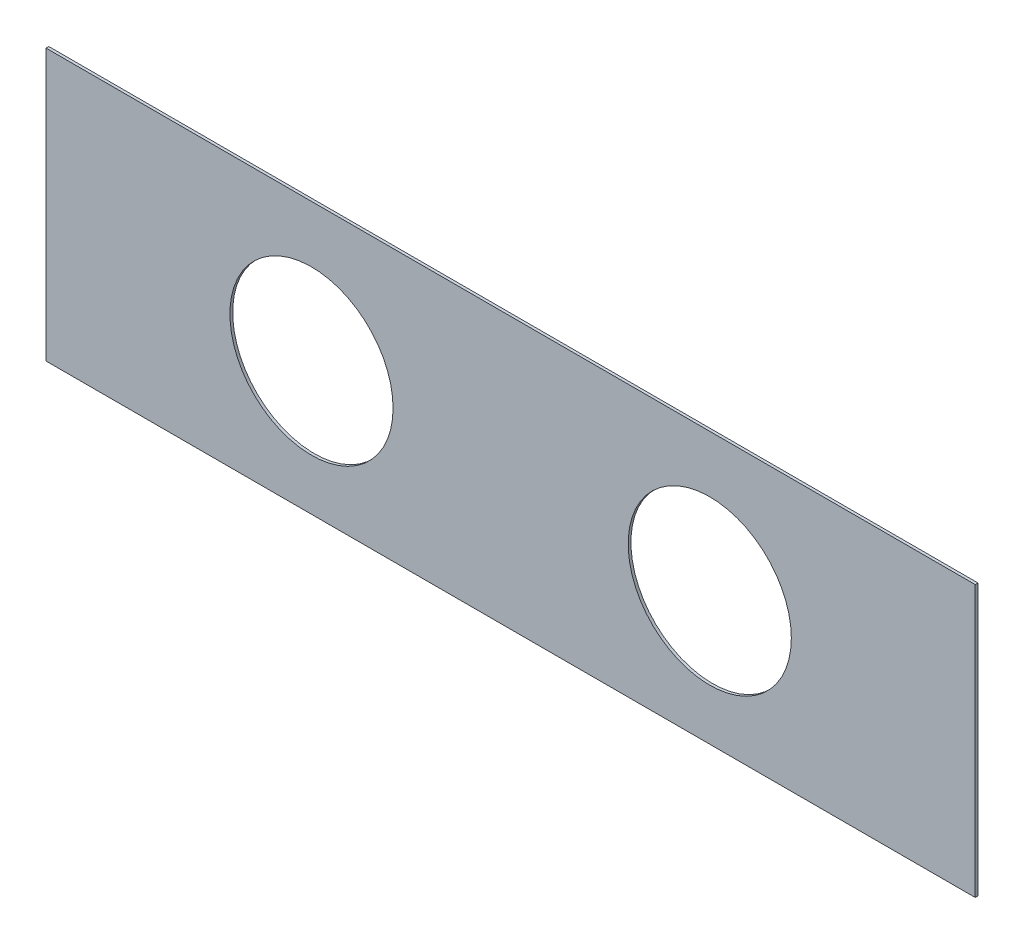
ISO-10303-21;
HEADER;
FILE_DESCRIPTION(('STEP AP214'),'2;1');
FILE_NAME('part.step','',(''),(''),'','','');
FILE_SCHEMA(('AUTOMOTIVE_DESIGN { 1 0 10303 214 1 1 1 1 }'));
ENDSEC;
DATA;
#1=APPLICATION_CONTEXT('core data for automotive mechanical design processes');
#2=APPLICATION_PROTOCOL_DEFINITION('international standard','automotive_design',2000,#1);
#3=PRODUCT_CONTEXT('',#1,'mechanical');
#4=PRODUCT('Part','Part','',(#3));
#5=PRODUCT_RELATED_PRODUCT_CATEGORY('part','',(#4));
#6=PRODUCT_DEFINITION_FORMATION('','',#4);
#7=PRODUCT_DEFINITION_CONTEXT('part definition',#1,'design');
#8=PRODUCT_DEFINITION('design','',#6,#7);
#9=PRODUCT_DEFINITION_SHAPE('','',#8);
#10=(LENGTH_UNIT() NAMED_UNIT(*) SI_UNIT(.MILLI.,.METRE.));
#11=(NAMED_UNIT(*) PLANE_ANGLE_UNIT() SI_UNIT($,.RADIAN.));
#12=(NAMED_UNIT(*) SI_UNIT($,.STERADIAN.) SOLID_ANGLE_UNIT());
#13=UNCERTAINTY_MEASURE_WITH_UNIT(LENGTH_MEASURE(1.E-05),#10,'distance_accuracy_value','');
#14=(GEOMETRIC_REPRESENTATION_CONTEXT(3) GLOBAL_UNCERTAINTY_ASSIGNED_CONTEXT((#13)) GLOBAL_UNIT_ASSIGNED_CONTEXT((#10,
#11,#12)) REPRESENTATION_CONTEXT('',''));
#15=CARTESIAN_POINT('',(0.,0.,0.));
#16=DIRECTION('',(0.,0.,1.));
#17=DIRECTION('',(1.,0.,0.));
#18=AXIS2_PLACEMENT_3D('',#15,#16,#17);
#19=CARTESIAN_POINT('',(533.4,155.575,3.175));
#20=DIRECTION('',(-1.,0.,0.));
#21=DIRECTION('',(0.,0.,1.));
#22=AXIS2_PLACEMENT_3D('',#19,#20,#21);
#23=PLANE('',#22);
#24=DIRECTION('',(0.,1.,0.));
#25=VECTOR('',#24,1.);
#26=CARTESIAN_POINT('',(533.4,155.575,0.));
#27=LINE('',#26,#25);
#28=CARTESIAN_POINT('',(533.4,-155.575,0.));
#29=VERTEX_POINT('',#28);
#30=CARTESIAN_POINT('',(533.4,155.575,0.));
#31=VERTEX_POINT('',#30);
#32=EDGE_CURVE('E96',#29,#31,#27,.T.);
#33=ORIENTED_EDGE('',*,*,#32,.T.);
#34=DIRECTION('',(0.,0.,-1.));
#35=VECTOR('',#34,1.);
#36=CARTESIAN_POINT('',(533.4,155.575,3.175));
#37=LINE('',#36,#35);
#38=CARTESIAN_POINT('',(533.4,155.575,3.175));
#39=VERTEX_POINT('',#38);
#40=EDGE_CURVE('E11',#39,#31,#37,.T.);
#41=ORIENTED_EDGE('',*,*,#40,.F.);
#42=DIRECTION('',(0.,1.,0.));
#43=VECTOR('',#42,1.);
#44=CARTESIAN_POINT('',(533.4,155.575,3.175));
#45=LINE('',#44,#43);
#46=CARTESIAN_POINT('',(533.4,-155.575,3.175));
#47=VERTEX_POINT('',#46);
#48=EDGE_CURVE('E84',#47,#39,#45,.T.);
#49=ORIENTED_EDGE('',*,*,#48,.F.);
#50=DIRECTION('',(0.,0.,-1.));
#51=VECTOR('',#50,1.);
#52=CARTESIAN_POINT('',(533.4,-155.575,3.175));
#53=LINE('',#52,#51);
#54=EDGE_CURVE('E92',#47,#29,#53,.T.);
#55=ORIENTED_EDGE('',*,*,#54,.T.);
#56=EDGE_LOOP('',(#33,#41,#49,#55));
#57=FACE_BOUND('',#56,.T.);
#58=ADVANCED_FACE('F33',(#57),#23,.F.);
#59=CARTESIAN_POINT('',(-533.4,155.575,3.175));
#60=DIRECTION('',(0.,-1.,0.));
#61=DIRECTION('',(0.,0.,-1.));
#62=AXIS2_PLACEMENT_3D('',#59,#60,#61);
#63=PLANE('',#62);
#64=DIRECTION('',(-1.,0.,0.));
#65=VECTOR('',#64,1.);
#66=CARTESIAN_POINT('',(-533.4,155.575,0.));
#67=LINE('',#66,#65);
#68=CARTESIAN_POINT('',(-533.4,155.575,0.));
#69=VERTEX_POINT('',#68);
#70=EDGE_CURVE('E88',#31,#69,#67,.T.);
#71=ORIENTED_EDGE('',*,*,#70,.T.);
#72=DIRECTION('',(0.,0.,-1.));
#73=VECTOR('',#72,1.);
#74=CARTESIAN_POINT('',(-533.4,155.575,3.175));
#75=LINE('',#74,#73);
#76=CARTESIAN_POINT('',(-533.4,155.575,3.175));
#77=VERTEX_POINT('',#76);
#78=EDGE_CURVE('E41',#77,#69,#75,.T.);
#79=ORIENTED_EDGE('',*,*,#78,.F.);
#80=DIRECTION('',(-1.,0.,0.));
#81=VECTOR('',#80,1.);
#82=CARTESIAN_POINT('',(-533.4,155.575,3.175));
#83=LINE('',#82,#81);
#84=EDGE_CURVE('E79',#39,#77,#83,.T.);
#85=ORIENTED_EDGE('',*,*,#84,.F.);
#86=ORIENTED_EDGE('',*,*,#40,.T.);
#87=EDGE_LOOP('',(#71,#79,#85,#86));
#88=FACE_BOUND('',#87,.T.);
#89=ADVANCED_FACE('F87',(#88),#63,.F.);
#90=CARTESIAN_POINT('',(-533.4,155.575,3.175));
#91=DIRECTION('',(1.,0.,0.));
#92=DIRECTION('',(0.,0.,-1.));
#93=AXIS2_PLACEMENT_3D('',#90,#91,#92);
#94=PLANE('',#93);
#95=DIRECTION('',(0.,-1.,0.));
#96=VECTOR('',#95,1.);
#97=CARTESIAN_POINT('',(-533.4,155.575,0.));
#98=LINE('',#97,#96);
#99=CARTESIAN_POINT('',(-533.4,-155.575,0.));
#100=VERTEX_POINT('',#99);
#101=EDGE_CURVE('E66',#69,#100,#98,.T.);
#102=ORIENTED_EDGE('',*,*,#101,.T.);
#103=DIRECTION('',(0.,0.,-1.));
#104=VECTOR('',#103,1.);
#105=CARTESIAN_POINT('',(-533.4,-155.575,3.175));
#106=LINE('',#105,#104);
#107=CARTESIAN_POINT('',(-533.4,-155.575,3.175));
#108=VERTEX_POINT('',#107);
#109=EDGE_CURVE('E89',#108,#100,#106,.T.);
#110=ORIENTED_EDGE('',*,*,#109,.F.);
#111=DIRECTION('',(0.,-1.,0.));
#112=VECTOR('',#111,1.);
#113=CARTESIAN_POINT('',(-533.4,155.575,3.175));
#114=LINE('',#113,#112);
#115=EDGE_CURVE('E82',#77,#108,#114,.T.);
#116=ORIENTED_EDGE('',*,*,#115,.F.);
#117=ORIENTED_EDGE('',*,*,#78,.T.);
#118=EDGE_LOOP('',(#102,#110,#116,#117));
#119=FACE_BOUND('',#118,.T.);
#120=ADVANCED_FACE('F90',(#119),#94,.F.);
#121=CARTESIAN_POINT('',(-533.4,-155.575,3.175));
#122=DIRECTION('',(0.,1.,0.));
#123=DIRECTION('',(0.,0.,1.));
#124=AXIS2_PLACEMENT_3D('',#121,#122,#123);
#125=PLANE('',#124);
#126=DIRECTION('',(1.,0.,0.));
#127=VECTOR('',#126,1.);
#128=CARTESIAN_POINT('',(-533.4,-155.575,0.));
#129=LINE('',#128,#127);
#130=EDGE_CURVE('E72',#100,#29,#129,.T.);
#131=ORIENTED_EDGE('',*,*,#130,.T.);
#132=ORIENTED_EDGE('',*,*,#54,.F.);
#133=DIRECTION('',(1.,0.,0.));
#134=VECTOR('',#133,1.);
#135=CARTESIAN_POINT('',(-533.4,-155.575,3.175));
#136=LINE('',#135,#134);
#137=EDGE_CURVE('E49',#108,#47,#136,.T.);
#138=ORIENTED_EDGE('',*,*,#137,.F.);
#139=ORIENTED_EDGE('',*,*,#109,.T.);
#140=EDGE_LOOP('',(#131,#132,#138,#139));
#141=FACE_BOUND('',#140,.T.);
#142=ADVANCED_FACE('F104',(#141),#125,.F.);
#143=CARTESIAN_POINT('',(0.,0.,3.175));
#144=DIRECTION('',(0.,0.,1.));
#145=DIRECTION('',(1.,0.,0.));
#146=AXIS2_PLACEMENT_3D('',#143,#144,#145);
#147=PLANE('',#146);
#148=CARTESIAN_POINT('',(-228.6,-3.17499999999998,3.175));
#149=DIRECTION('',(0.,0.,1.));
#150=DIRECTION('',(1.,0.,0.));
#151=AXIS2_PLACEMENT_3D('',#148,#149,#150);
#152=CIRCLE('',#151,93.6625);
#153=CARTESIAN_POINT('',(-134.9375,-3.17499999999998,3.175));
#154=VERTEX_POINT('',#153);
#155=EDGE_CURVE('E118',#154,#154,#152,.T.);
#156=ORIENTED_EDGE('',*,*,#155,.F.);
#157=EDGE_LOOP('',(#156));
#158=FACE_BOUND('',#157,.T.);
#159=CARTESIAN_POINT('',(228.6,-3.17499999999993,3.175));
#160=DIRECTION('',(0.,0.,1.));
#161=DIRECTION('',(1.,0.,0.));
#162=AXIS2_PLACEMENT_3D('',#159,#160,#161);
#163=CIRCLE('',#162,93.6625);
#164=CARTESIAN_POINT('',(322.2625,-3.17499999999993,3.175));
#165=VERTEX_POINT('',#164);
#166=EDGE_CURVE('E112',#165,#165,#163,.T.);
#167=ORIENTED_EDGE('',*,*,#166,.F.);
#168=EDGE_LOOP('',(#167));
#169=FACE_BOUND('',#168,.T.);
#170=ORIENTED_EDGE('',*,*,#48,.T.);
#171=ORIENTED_EDGE('',*,*,#84,.T.);
#172=ORIENTED_EDGE('',*,*,#115,.T.);
#173=ORIENTED_EDGE('',*,*,#137,.T.);
#174=EDGE_LOOP('',(#170,#171,#172,#173));
#175=FACE_BOUND('',#174,.T.);
#176=ADVANCED_FACE('F80',(#158,#169,#175),#147,.T.);
#177=CARTESIAN_POINT('',(0.,0.,0.));
#178=DIRECTION('',(0.,0.,1.));
#179=DIRECTION('',(1.,0.,0.));
#180=AXIS2_PLACEMENT_3D('',#177,#178,#179);
#181=PLANE('',#180);
#182=CARTESIAN_POINT('',(-228.6,-3.17499999999998,0.));
#183=DIRECTION('',(0.,0.,1.));
#184=DIRECTION('',(1.,0.,0.));
#185=AXIS2_PLACEMENT_3D('',#182,#183,#184);
#186=CIRCLE('',#185,93.6625);
#187=CARTESIAN_POINT('',(-134.9375,-3.17499999999998,0.));
#188=VERTEX_POINT('',#187);
#189=EDGE_CURVE('E115',#188,#188,#186,.F.);
#190=ORIENTED_EDGE('',*,*,#189,.F.);
#191=EDGE_LOOP('',(#190));
#192=FACE_BOUND('',#191,.T.);
#193=CARTESIAN_POINT('',(228.6,-3.17499999999993,0.));
#194=DIRECTION('',(0.,0.,1.));
#195=DIRECTION('',(1.,0.,0.));
#196=AXIS2_PLACEMENT_3D('',#193,#194,#195);
#197=CIRCLE('',#196,93.6625);
#198=CARTESIAN_POINT('',(322.2625,-3.17499999999993,0.));
#199=VERTEX_POINT('',#198);
#200=EDGE_CURVE('E99',#199,#199,#197,.F.);
#201=ORIENTED_EDGE('',*,*,#200,.F.);
#202=EDGE_LOOP('',(#201));
#203=FACE_BOUND('',#202,.T.);
#204=ORIENTED_EDGE('',*,*,#32,.F.);
#205=ORIENTED_EDGE('',*,*,#130,.F.);
#206=ORIENTED_EDGE('',*,*,#101,.F.);
#207=ORIENTED_EDGE('',*,*,#70,.F.);
#208=EDGE_LOOP('',(#204,#205,#206,#207));
#209=FACE_BOUND('',#208,.T.);
#210=ADVANCED_FACE('F107',(#192,#203,#209),#181,.F.);
#211=CARTESIAN_POINT('',(228.6,-3.17499999999993,-0.00100000000000013));
#212=DIRECTION('',(0.,0.,1.));
#213=DIRECTION('',(1.,0.,0.));
#214=AXIS2_PLACEMENT_3D('',#211,#212,#213);
#215=CYLINDRICAL_SURFACE('',#214,93.6625);
#216=ORIENTED_EDGE('',*,*,#166,.T.);
#217=EDGE_LOOP('',(#216));
#218=FACE_BOUND('',#217,.T.);
#219=ORIENTED_EDGE('',*,*,#200,.T.);
#220=EDGE_LOOP('',(#219));
#221=FACE_BOUND('',#220,.T.);
#222=ADVANCED_FACE('F130',(#218,#221),#215,.F.);
#223=CARTESIAN_POINT('',(-228.6,-3.17499999999998,-0.00100000000000013));
#224=DIRECTION('',(0.,0.,1.));
#225=DIRECTION('',(1.,0.,0.));
#226=AXIS2_PLACEMENT_3D('',#223,#224,#225);
#227=CYLINDRICAL_SURFACE('',#226,93.6625);
#228=ORIENTED_EDGE('',*,*,#155,.T.);
#229=EDGE_LOOP('',(#228));
#230=FACE_BOUND('',#229,.T.);
#231=ORIENTED_EDGE('',*,*,#189,.T.);
#232=EDGE_LOOP('',(#231));
#233=FACE_BOUND('',#232,.T.);
#234=ADVANCED_FACE('F122',(#230,#233),#227,.F.);
#235=CLOSED_SHELL('',(#58,#89,#120,#142,#176,#210,#222,#234));
#236=MANIFOLD_SOLID_BREP('B2',#235);
#237=ADVANCED_BREP_SHAPE_REPRESENTATION('',(#18,#236),#14);
#238=SHAPE_DEFINITION_REPRESENTATION(#9,#237);
ENDSEC;
END-ISO-10303-21;
